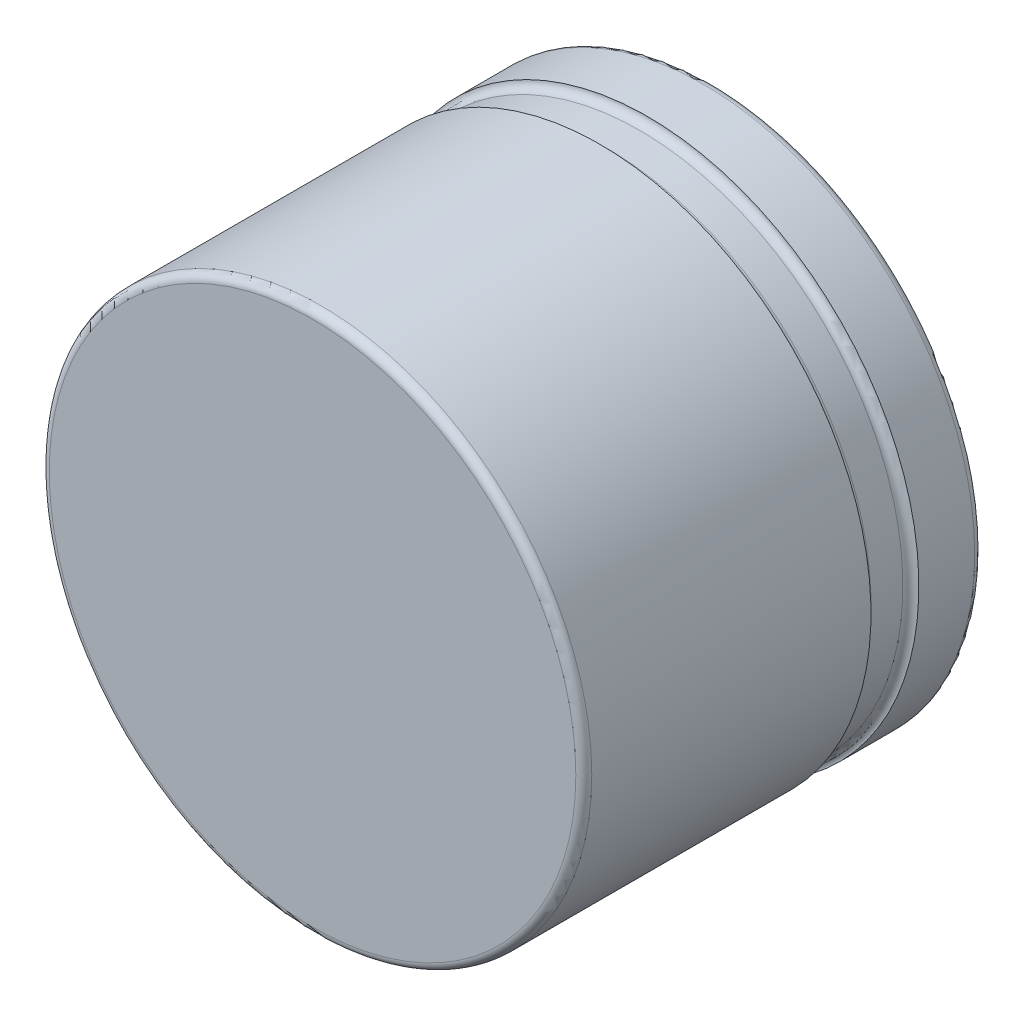
ISO-10303-21;
HEADER;
FILE_DESCRIPTION(('STEP AP214'),'2;1');
FILE_NAME('part.step','',(''),(''),'','','');
FILE_SCHEMA(('AUTOMOTIVE_DESIGN { 1 0 10303 214 1 1 1 1 }'));
ENDSEC;
DATA;
#1=APPLICATION_CONTEXT('core data for automotive mechanical design processes');
#2=APPLICATION_PROTOCOL_DEFINITION('international standard','automotive_design',2000,#1);
#3=PRODUCT_CONTEXT('',#1,'mechanical');
#4=PRODUCT('Part','Part','',(#3));
#5=PRODUCT_RELATED_PRODUCT_CATEGORY('part','',(#4));
#6=PRODUCT_DEFINITION_FORMATION('','',#4);
#7=PRODUCT_DEFINITION_CONTEXT('part definition',#1,'design');
#8=PRODUCT_DEFINITION('design','',#6,#7);
#9=PRODUCT_DEFINITION_SHAPE('','',#8);
#10=(LENGTH_UNIT() NAMED_UNIT(*) SI_UNIT(.MILLI.,.METRE.));
#11=(NAMED_UNIT(*) PLANE_ANGLE_UNIT() SI_UNIT($,.RADIAN.));
#12=(NAMED_UNIT(*) SI_UNIT($,.STERADIAN.) SOLID_ANGLE_UNIT());
#13=UNCERTAINTY_MEASURE_WITH_UNIT(LENGTH_MEASURE(1.E-05),#10,'distance_accuracy_value','');
#14=(GEOMETRIC_REPRESENTATION_CONTEXT(3) GLOBAL_UNCERTAINTY_ASSIGNED_CONTEXT((#13)) GLOBAL_UNIT_ASSIGNED_CONTEXT((#10,
#11,#12)) REPRESENTATION_CONTEXT('',''));
#15=CARTESIAN_POINT('',(0.,0.,0.));
#16=DIRECTION('',(0.,0.,1.));
#17=DIRECTION('',(1.,0.,0.));
#18=AXIS2_PLACEMENT_3D('',#15,#16,#17);
#19=CARTESIAN_POINT('',(0.,0.,5.));
#20=DIRECTION('',(0.,0.,-1.));
#21=DIRECTION('',(-1.,0.,0.));
#22=AXIS2_PLACEMENT_3D('',#19,#20,#21);
#23=CYLINDRICAL_SURFACE('',#22,3.4);
#24=CARTESIAN_POINT('',(0.,0.,4.9));
#25=DIRECTION('',(0.,0.,1.));
#26=DIRECTION('',(1.,0.,0.));
#27=AXIS2_PLACEMENT_3D('',#24,#25,#26);
#28=CIRCLE('',#27,3.4);
#29=CARTESIAN_POINT('',(3.4,0.,4.9));
#30=VERTEX_POINT('',#29);
#31=EDGE_CURVE('E50',#30,#30,#28,.F.);
#32=ORIENTED_EDGE('',*,*,#31,.T.);
#33=EDGE_LOOP('',(#32));
#34=FACE_BOUND('',#33,.T.);
#35=CARTESIAN_POINT('',(0.,0.,1.4));
#36=DIRECTION('',(0.,0.,-1.));
#37=DIRECTION('',(-1.,0.,0.));
#38=AXIS2_PLACEMENT_3D('',#35,#36,#37);
#39=CIRCLE('',#38,3.4);
#40=CARTESIAN_POINT('',(-3.4,0.,1.4));
#41=VERTEX_POINT('',#40);
#42=EDGE_CURVE('E51',#41,#41,#39,.T.);
#43=ORIENTED_EDGE('',*,*,#42,.F.);
#44=EDGE_LOOP('',(#43));
#45=FACE_BOUND('',#44,.T.);
#46=ADVANCED_FACE('F30',(#34,#45),#23,.T.);
#47=CARTESIAN_POINT('',(0.,0.,5.));
#48=DIRECTION('',(0.,0.,1.));
#49=DIRECTION('',(1.,0.,0.));
#50=AXIS2_PLACEMENT_3D('',#47,#48,#49);
#51=PLANE('',#50);
#52=CARTESIAN_POINT('',(0.,0.,5.));
#53=DIRECTION('',(0.,0.,1.));
#54=DIRECTION('',(1.,0.,0.));
#55=AXIS2_PLACEMENT_3D('',#52,#53,#54);
#56=CIRCLE('',#55,3.3);
#57=CARTESIAN_POINT('',(3.3,0.,5.));
#58=VERTEX_POINT('',#57);
#59=EDGE_CURVE('E54',#58,#58,#56,.T.);
#60=ORIENTED_EDGE('',*,*,#59,.T.);
#61=EDGE_LOOP('',(#60));
#62=FACE_BOUND('',#61,.T.);
#63=ADVANCED_FACE('F63',(#62),#51,.T.);
#64=CARTESIAN_POINT('',(0.,0.,4.9));
#65=DIRECTION('',(0.,0.,1.));
#66=DIRECTION('',(1.,0.,0.));
#67=AXIS2_PLACEMENT_3D('',#64,#65,#66);
#68=TOROIDAL_SURFACE('',#67,3.3,0.1);
#69=ORIENTED_EDGE('',*,*,#31,.F.);
#70=EDGE_LOOP('',(#69));
#71=FACE_BOUND('',#70,.T.);
#72=ORIENTED_EDGE('',*,*,#59,.F.);
#73=EDGE_LOOP('',(#72));
#74=FACE_BOUND('',#73,.T.);
#75=ADVANCED_FACE('F65',(#71,#74),#68,.T.);
#76=CARTESIAN_POINT('',(0.,0.,1.4));
#77=DIRECTION('',(0.,0.,-1.));
#78=DIRECTION('',(-1.,0.,0.));
#79=AXIS2_PLACEMENT_3D('',#76,#77,#78);
#80=CYLINDRICAL_SURFACE('',#79,3.3);
#81=CARTESIAN_POINT('',(0.,0.,0.9));
#82=DIRECTION('',(0.,0.,-1.));
#83=DIRECTION('',(-1.,0.,0.));
#84=AXIS2_PLACEMENT_3D('',#81,#82,#83);
#85=CIRCLE('',#84,3.3);
#86=CARTESIAN_POINT('',(-3.3,0.,0.9));
#87=VERTEX_POINT('',#86);
#88=EDGE_CURVE('E11',#87,#87,#85,.F.);
#89=ORIENTED_EDGE('',*,*,#88,.T.);
#90=EDGE_LOOP('',(#89));
#91=FACE_BOUND('',#90,.T.);
#92=CARTESIAN_POINT('',(0.,0.,1.3));
#93=DIRECTION('',(0.,0.,-1.));
#94=DIRECTION('',(-1.,0.,0.));
#95=AXIS2_PLACEMENT_3D('',#92,#93,#94);
#96=CIRCLE('',#95,3.3);
#97=CARTESIAN_POINT('',(-3.3,0.,1.3));
#98=VERTEX_POINT('',#97);
#99=EDGE_CURVE('E37',#98,#98,#96,.T.);
#100=ORIENTED_EDGE('',*,*,#99,.T.);
#101=EDGE_LOOP('',(#100));
#102=FACE_BOUND('',#101,.T.);
#103=ADVANCED_FACE('F67',(#91,#102),#80,.T.);
#104=CARTESIAN_POINT('',(0.,0.,0.));
#105=DIRECTION('',(0.,0.,1.));
#106=DIRECTION('',(1.,0.,0.));
#107=AXIS2_PLACEMENT_3D('',#104,#105,#106);
#108=PLANE('',#107);
#109=CARTESIAN_POINT('',(0.,0.,0.));
#110=DIRECTION('',(0.,0.,1.));
#111=DIRECTION('',(1.,0.,0.));
#112=AXIS2_PLACEMENT_3D('',#109,#110,#111);
#113=CIRCLE('',#112,3.3);
#114=CARTESIAN_POINT('',(3.3,0.,0.));
#115=VERTEX_POINT('',#114);
#116=EDGE_CURVE('E41',#115,#115,#113,.F.);
#117=ORIENTED_EDGE('',*,*,#116,.T.);
#118=EDGE_LOOP('',(#117));
#119=FACE_BOUND('',#118,.T.);
#120=ADVANCED_FACE('F74',(#119),#108,.F.);
#121=CARTESIAN_POINT('',(0.,0.,0.1));
#122=DIRECTION('',(0.,0.,1.));
#123=DIRECTION('',(1.,0.,0.));
#124=AXIS2_PLACEMENT_3D('',#121,#122,#123);
#125=CIRCLE('',#124,3.4);
#126=CARTESIAN_POINT('',(3.4,0.,0.1));
#127=VERTEX_POINT('',#126);
#128=EDGE_CURVE('E45',#127,#127,#125,.T.);
#129=ORIENTED_EDGE('',*,*,#128,.T.);
#130=EDGE_LOOP('',(#129));
#131=FACE_BOUND('',#130,.T.);
#132=CARTESIAN_POINT('',(0.,0.,0.8));
#133=DIRECTION('',(0.,0.,-1.));
#134=DIRECTION('',(-1.,0.,0.));
#135=AXIS2_PLACEMENT_3D('',#132,#133,#134);
#136=CIRCLE('',#135,3.4);
#137=CARTESIAN_POINT('',(-3.4,0.,0.8));
#138=VERTEX_POINT('',#137);
#139=EDGE_CURVE('E55',#138,#138,#136,.T.);
#140=ORIENTED_EDGE('',*,*,#139,.T.);
#141=EDGE_LOOP('',(#140));
#142=FACE_BOUND('',#141,.T.);
#143=ADVANCED_FACE('F82',(#131,#142),#23,.T.);
#144=CARTESIAN_POINT('',(0.,0.,0.1));
#145=DIRECTION('',(0.,0.,1.));
#146=DIRECTION('',(1.,0.,0.));
#147=AXIS2_PLACEMENT_3D('',#144,#145,#146);
#148=TOROIDAL_SURFACE('',#147,3.3,0.1);
#149=ORIENTED_EDGE('',*,*,#116,.F.);
#150=EDGE_LOOP('',(#149));
#151=FACE_BOUND('',#150,.T.);
#152=ORIENTED_EDGE('',*,*,#128,.F.);
#153=EDGE_LOOP('',(#152));
#154=FACE_BOUND('',#153,.T.);
#155=ADVANCED_FACE('F88',(#151,#154),#148,.T.);
#156=CARTESIAN_POINT('',(0.,0.,0.9));
#157=DIRECTION('',(0.,0.,-1.));
#158=DIRECTION('',(-1.,0.,0.));
#159=AXIS2_PLACEMENT_3D('',#156,#157,#158);
#160=TOROIDAL_SURFACE('',#159,3.4,0.1);
#161=ORIENTED_EDGE('',*,*,#88,.F.);
#162=EDGE_LOOP('',(#161));
#163=FACE_BOUND('',#162,.T.);
#164=ORIENTED_EDGE('',*,*,#139,.F.);
#165=EDGE_LOOP('',(#164));
#166=FACE_BOUND('',#165,.T.);
#167=ADVANCED_FACE('F94',(#163,#166),#160,.F.);
#168=CARTESIAN_POINT('',(0.,0.,1.3));
#169=DIRECTION('',(0.,0.,-1.));
#170=DIRECTION('',(-1.,0.,0.));
#171=AXIS2_PLACEMENT_3D('',#168,#169,#170);
#172=TOROIDAL_SURFACE('',#171,3.4,0.1);
#173=ORIENTED_EDGE('',*,*,#42,.T.);
#174=EDGE_LOOP('',(#173));
#175=FACE_BOUND('',#174,.T.);
#176=ORIENTED_EDGE('',*,*,#99,.F.);
#177=EDGE_LOOP('',(#176));
#178=FACE_BOUND('',#177,.T.);
#179=ADVANCED_FACE('F32',(#175,#178),#172,.F.);
#180=CLOSED_SHELL('',(#46,#63,#75,#103,#120,#143,#155,#167,#179));
#181=MANIFOLD_SOLID_BREP('B2',#180);
#182=ADVANCED_BREP_SHAPE_REPRESENTATION('',(#18,#181),#14);
#183=SHAPE_DEFINITION_REPRESENTATION(#9,#182);
ENDSEC;
END-ISO-10303-21;
